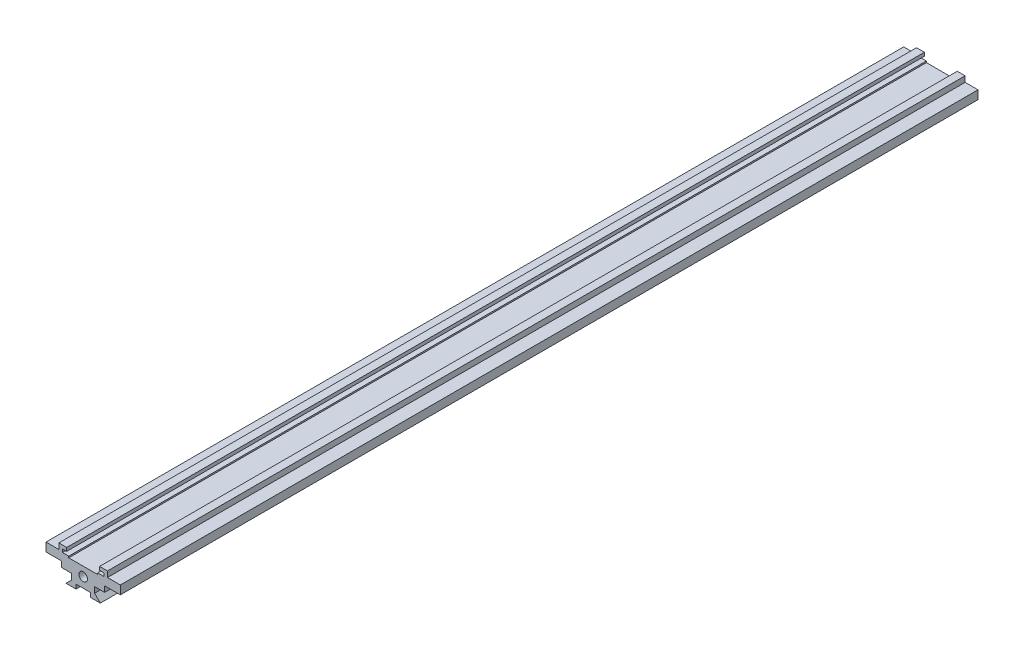
ISO-10303-21;
HEADER;
FILE_DESCRIPTION(('STEP AP214'),'2;1');
FILE_NAME('part.step','',(''),(''),'','','');
FILE_SCHEMA(('AUTOMOTIVE_DESIGN { 1 0 10303 214 1 1 1 1 }'));
ENDSEC;
DATA;
#1=APPLICATION_CONTEXT('core data for automotive mechanical design processes');
#2=APPLICATION_PROTOCOL_DEFINITION('international standard','automotive_design',2000,#1);
#3=PRODUCT_CONTEXT('',#1,'mechanical');
#4=PRODUCT('Part','Part','',(#3));
#5=PRODUCT_RELATED_PRODUCT_CATEGORY('part','',(#4));
#6=PRODUCT_DEFINITION_FORMATION('','',#4);
#7=PRODUCT_DEFINITION_CONTEXT('part definition',#1,'design');
#8=PRODUCT_DEFINITION('design','',#6,#7);
#9=PRODUCT_DEFINITION_SHAPE('','',#8);
#10=(LENGTH_UNIT() NAMED_UNIT(*) SI_UNIT(.MILLI.,.METRE.));
#11=(NAMED_UNIT(*) PLANE_ANGLE_UNIT() SI_UNIT($,.RADIAN.));
#12=(NAMED_UNIT(*) SI_UNIT($,.STERADIAN.) SOLID_ANGLE_UNIT());
#13=UNCERTAINTY_MEASURE_WITH_UNIT(LENGTH_MEASURE(1.E-05),#10,'distance_accuracy_value','');
#14=(GEOMETRIC_REPRESENTATION_CONTEXT(3) GLOBAL_UNCERTAINTY_ASSIGNED_CONTEXT((#13)) GLOBAL_UNIT_ASSIGNED_CONTEXT((#10,
#11,#12)) REPRESENTATION_CONTEXT('',''));
#15=CARTESIAN_POINT('',(0.,0.,0.));
#16=DIRECTION('',(0.,0.,1.));
#17=DIRECTION('',(1.,0.,0.));
#18=AXIS2_PLACEMENT_3D('',#15,#16,#17);
#19=CARTESIAN_POINT('',(-13.,9.,150.));
#20=DIRECTION('',(0.,0.,-1.));
#21=DIRECTION('',(-1.,0.,0.));
#22=AXIS2_PLACEMENT_3D('',#19,#20,#21);
#23=PLANE('',#22);
#24=DIRECTION('',(1.,0.,0.));
#25=VECTOR('',#24,1.);
#26=CARTESIAN_POINT('',(-6.,0.,150.));
#27=LINE('',#26,#25);
#28=CARTESIAN_POINT('',(-6.,0.,150.));
#29=VERTEX_POINT('',#28);
#30=CARTESIAN_POINT('',(-2.5,0.,150.));
#31=VERTEX_POINT('',#30);
#32=EDGE_CURVE('E298',#29,#31,#27,.T.);
#33=ORIENTED_EDGE('',*,*,#32,.T.);
#34=DIRECTION('',(0.,-1.,0.));
#35=VECTOR('',#34,1.);
#36=CARTESIAN_POINT('',(-2.5,0.,150.));
#37=LINE('',#36,#35);
#38=CARTESIAN_POINT('',(-2.5,1.5,150.));
#39=VERTEX_POINT('',#38);
#40=EDGE_CURVE('E484',#39,#31,#37,.T.);
#41=ORIENTED_EDGE('',*,*,#40,.F.);
#42=DIRECTION('',(-1.,0.,0.));
#43=VECTOR('',#42,1.);
#44=CARTESIAN_POINT('',(-2.5,1.5,150.));
#45=LINE('',#44,#43);
#46=CARTESIAN_POINT('',(2.5,1.5,150.));
#47=VERTEX_POINT('',#46);
#48=EDGE_CURVE('E489',#47,#39,#45,.T.);
#49=ORIENTED_EDGE('',*,*,#48,.F.);
#50=DIRECTION('',(0.,1.,0.));
#51=VECTOR('',#50,1.);
#52=CARTESIAN_POINT('',(2.5,0.,150.));
#53=LINE('',#52,#51);
#54=CARTESIAN_POINT('',(2.5,0.,150.));
#55=VERTEX_POINT('',#54);
#56=EDGE_CURVE('E487',#55,#47,#53,.T.);
#57=ORIENTED_EDGE('',*,*,#56,.F.);
#58=CARTESIAN_POINT('',(6.,0.,150.));
#59=VERTEX_POINT('',#58);
#60=EDGE_CURVE('E297',#55,#59,#27,.T.);
#61=ORIENTED_EDGE('',*,*,#60,.T.);
#62=DIRECTION('',(-0.707106781186549,0.707106781186546,0.));
#63=VECTOR('',#62,1.);
#64=CARTESIAN_POINT('',(6.,0.,150.));
#65=LINE('',#64,#63);
#66=CARTESIAN_POINT('',(4.,1.99999999999999,150.));
#67=VERTEX_POINT('',#66);
#68=EDGE_CURVE('E301',#59,#67,#65,.T.);
#69=ORIENTED_EDGE('',*,*,#68,.T.);
#70=DIRECTION('',(0.,1.,0.));
#71=VECTOR('',#70,1.);
#72=CARTESIAN_POINT('',(4.,1.99999999999999,150.));
#73=LINE('',#72,#71);
#74=CARTESIAN_POINT('',(4.,3.99999999999999,150.));
#75=VERTEX_POINT('',#74);
#76=EDGE_CURVE('E304',#67,#75,#73,.T.);
#77=ORIENTED_EDGE('',*,*,#76,.T.);
#78=DIRECTION('',(1.,0.,0.));
#79=VECTOR('',#78,1.);
#80=CARTESIAN_POINT('',(7.5,3.99999999999999,150.));
#81=LINE('',#80,#79);
#82=CARTESIAN_POINT('',(7.5,3.99999999999999,150.));
#83=VERTEX_POINT('',#82);
#84=EDGE_CURVE('E307',#75,#83,#81,.T.);
#85=ORIENTED_EDGE('',*,*,#84,.T.);
#86=DIRECTION('',(0.,1.,0.));
#87=VECTOR('',#86,1.);
#88=CARTESIAN_POINT('',(7.5,3.99999999999999,150.));
#89=LINE('',#88,#87);
#90=CARTESIAN_POINT('',(7.5,5.99999999999999,150.));
#91=VERTEX_POINT('',#90);
#92=EDGE_CURVE('E310',#83,#91,#89,.T.);
#93=ORIENTED_EDGE('',*,*,#92,.T.);
#94=DIRECTION('',(1.,0.,0.));
#95=VECTOR('',#94,1.);
#96=CARTESIAN_POINT('',(13.,5.99999999999999,150.));
#97=LINE('',#96,#95);
#98=CARTESIAN_POINT('',(13.,5.99999999999999,150.));
#99=VERTEX_POINT('',#98);
#100=EDGE_CURVE('E313',#91,#99,#97,.T.);
#101=ORIENTED_EDGE('',*,*,#100,.T.);
#102=DIRECTION('',(0.,1.,0.));
#103=VECTOR('',#102,1.);
#104=CARTESIAN_POINT('',(13.,5.99999999999999,150.));
#105=LINE('',#104,#103);
#106=CARTESIAN_POINT('',(13.,9.,150.));
#107=VERTEX_POINT('',#106);
#108=EDGE_CURVE('E316',#99,#107,#105,.T.);
#109=ORIENTED_EDGE('',*,*,#108,.T.);
#110=DIRECTION('',(-1.,0.,0.));
#111=VECTOR('',#110,1.);
#112=CARTESIAN_POINT('',(8.5,9.,150.));
#113=LINE('',#112,#111);
#114=CARTESIAN_POINT('',(8.5,9.,150.));
#115=VERTEX_POINT('',#114);
#116=EDGE_CURVE('E319',#107,#115,#113,.T.);
#117=ORIENTED_EDGE('',*,*,#116,.T.);
#118=DIRECTION('',(0.,1.,0.));
#119=VECTOR('',#118,1.);
#120=CARTESIAN_POINT('',(8.5,9.,150.));
#121=LINE('',#120,#119);
#122=CARTESIAN_POINT('',(8.5,11.,150.));
#123=VERTEX_POINT('',#122);
#124=EDGE_CURVE('E322',#115,#123,#121,.T.);
#125=ORIENTED_EDGE('',*,*,#124,.T.);
#126=DIRECTION('',(-1.,0.,0.));
#127=VECTOR('',#126,1.);
#128=CARTESIAN_POINT('',(8.5,11.,150.));
#129=LINE('',#128,#127);
#130=CARTESIAN_POINT('',(5.75,11.,150.));
#131=VERTEX_POINT('',#130);
#132=EDGE_CURVE('E325',#123,#131,#129,.T.);
#133=ORIENTED_EDGE('',*,*,#132,.T.);
#134=DIRECTION('',(0.,-1.,0.));
#135=VECTOR('',#134,1.);
#136=CARTESIAN_POINT('',(5.75,11.,150.));
#137=LINE('',#136,#135);
#138=CARTESIAN_POINT('',(5.75,9.79999999999999,150.));
#139=VERTEX_POINT('',#138);
#140=EDGE_CURVE('E328',#131,#139,#137,.T.);
#141=ORIENTED_EDGE('',*,*,#140,.T.);
#142=DIRECTION('',(1.,0.,0.));
#143=VECTOR('',#142,1.);
#144=CARTESIAN_POINT('',(5.75,9.79999999999999,150.));
#145=LINE('',#144,#143);
#146=CARTESIAN_POINT('',(7.25,9.8,150.));
#147=VERTEX_POINT('',#146);
#148=EDGE_CURVE('E331',#139,#147,#145,.T.);
#149=ORIENTED_EDGE('',*,*,#148,.T.);
#150=DIRECTION('',(0.,-1.,0.));
#151=VECTOR('',#150,1.);
#152=CARTESIAN_POINT('',(7.25,9.8,150.));
#153=LINE('',#152,#151);
#154=CARTESIAN_POINT('',(7.25,8.7,150.));
#155=VERTEX_POINT('',#154);
#156=EDGE_CURVE('E334',#147,#155,#153,.T.);
#157=ORIENTED_EDGE('',*,*,#156,.T.);
#158=DIRECTION('',(-1.,0.,0.));
#159=VECTOR('',#158,1.);
#160=CARTESIAN_POINT('',(5.05,8.7,150.));
#161=LINE('',#160,#159);
#162=CARTESIAN_POINT('',(5.05,8.7,150.));
#163=VERTEX_POINT('',#162);
#164=EDGE_CURVE('E337',#155,#163,#161,.T.);
#165=ORIENTED_EDGE('',*,*,#164,.T.);
#166=DIRECTION('',(0.,-1.,0.));
#167=VECTOR('',#166,1.);
#168=CARTESIAN_POINT('',(5.05,8.2,150.));
#169=LINE('',#168,#167);
#170=CARTESIAN_POINT('',(5.05,8.2,150.));
#171=VERTEX_POINT('',#170);
#172=EDGE_CURVE('E340',#163,#171,#169,.T.);
#173=ORIENTED_EDGE('',*,*,#172,.T.);
#174=DIRECTION('',(-1.,0.,0.));
#175=VECTOR('',#174,1.);
#176=CARTESIAN_POINT('',(5.05,8.2,150.));
#177=LINE('',#176,#175);
#178=CARTESIAN_POINT('',(-5.05,8.2,150.));
#179=VERTEX_POINT('',#178);
#180=EDGE_CURVE('E343',#171,#179,#177,.T.);
#181=ORIENTED_EDGE('',*,*,#180,.T.);
#182=DIRECTION('',(0.,1.,0.));
#183=VECTOR('',#182,1.);
#184=CARTESIAN_POINT('',(-5.05,8.2,150.));
#185=LINE('',#184,#183);
#186=CARTESIAN_POINT('',(-5.05,8.7,150.));
#187=VERTEX_POINT('',#186);
#188=EDGE_CURVE('E346',#179,#187,#185,.T.);
#189=ORIENTED_EDGE('',*,*,#188,.T.);
#190=DIRECTION('',(-1.,0.,0.));
#191=VECTOR('',#190,1.);
#192=CARTESIAN_POINT('',(-5.05,8.7,150.));
#193=LINE('',#192,#191);
#194=CARTESIAN_POINT('',(-7.25,8.7,150.));
#195=VERTEX_POINT('',#194);
#196=EDGE_CURVE('E349',#187,#195,#193,.T.);
#197=ORIENTED_EDGE('',*,*,#196,.T.);
#198=DIRECTION('',(0.,1.,0.));
#199=VECTOR('',#198,1.);
#200=CARTESIAN_POINT('',(-7.25,9.8,150.));
#201=LINE('',#200,#199);
#202=CARTESIAN_POINT('',(-7.25,9.8,150.));
#203=VERTEX_POINT('',#202);
#204=EDGE_CURVE('E352',#195,#203,#201,.T.);
#205=ORIENTED_EDGE('',*,*,#204,.T.);
#206=DIRECTION('',(1.,0.,0.));
#207=VECTOR('',#206,1.);
#208=CARTESIAN_POINT('',(-5.75,9.79999999999999,150.));
#209=LINE('',#208,#207);
#210=CARTESIAN_POINT('',(-5.75,9.79999999999999,150.));
#211=VERTEX_POINT('',#210);
#212=EDGE_CURVE('E355',#203,#211,#209,.T.);
#213=ORIENTED_EDGE('',*,*,#212,.T.);
#214=DIRECTION('',(0.,1.,0.));
#215=VECTOR('',#214,1.);
#216=CARTESIAN_POINT('',(-5.75,11.,150.));
#217=LINE('',#216,#215);
#218=CARTESIAN_POINT('',(-5.75,11.,150.));
#219=VERTEX_POINT('',#218);
#220=EDGE_CURVE('E358',#211,#219,#217,.T.);
#221=ORIENTED_EDGE('',*,*,#220,.T.);
#222=DIRECTION('',(-1.,0.,0.));
#223=VECTOR('',#222,1.);
#224=CARTESIAN_POINT('',(-8.5,11.,150.));
#225=LINE('',#224,#223);
#226=CARTESIAN_POINT('',(-8.5,11.,150.));
#227=VERTEX_POINT('',#226);
#228=EDGE_CURVE('E250',#219,#227,#225,.T.);
#229=ORIENTED_EDGE('',*,*,#228,.T.);
#230=DIRECTION('',(0.,-1.,0.));
#231=VECTOR('',#230,1.);
#232=CARTESIAN_POINT('',(-8.5,9.,150.));
#233=LINE('',#232,#231);
#234=CARTESIAN_POINT('',(-8.5,9.,150.));
#235=VERTEX_POINT('',#234);
#236=EDGE_CURVE('E361',#227,#235,#233,.T.);
#237=ORIENTED_EDGE('',*,*,#236,.T.);
#238=DIRECTION('',(-1.,0.,0.));
#239=VECTOR('',#238,1.);
#240=CARTESIAN_POINT('',(-8.5,9.,150.));
#241=LINE('',#240,#239);
#242=CARTESIAN_POINT('',(-13.,9.,150.));
#243=VERTEX_POINT('',#242);
#244=EDGE_CURVE('E275',#235,#243,#241,.T.);
#245=ORIENTED_EDGE('',*,*,#244,.T.);
#246=DIRECTION('',(0.,-1.,0.));
#247=VECTOR('',#246,1.);
#248=CARTESIAN_POINT('',(-13.,5.99999999999999,150.));
#249=LINE('',#248,#247);
#250=CARTESIAN_POINT('',(-13.,5.99999999999999,150.));
#251=VERTEX_POINT('',#250);
#252=EDGE_CURVE('E278',#243,#251,#249,.T.);
#253=ORIENTED_EDGE('',*,*,#252,.T.);
#254=DIRECTION('',(1.,0.,0.));
#255=VECTOR('',#254,1.);
#256=CARTESIAN_POINT('',(-7.5,5.99999999999999,150.));
#257=LINE('',#256,#255);
#258=CARTESIAN_POINT('',(-7.5,5.99999999999999,150.));
#259=VERTEX_POINT('',#258);
#260=EDGE_CURVE('E282',#251,#259,#257,.T.);
#261=ORIENTED_EDGE('',*,*,#260,.T.);
#262=DIRECTION('',(0.,-1.,0.));
#263=VECTOR('',#262,1.);
#264=CARTESIAN_POINT('',(-7.5,3.99999999999999,150.));
#265=LINE('',#264,#263);
#266=CARTESIAN_POINT('',(-7.5,3.99999999999999,150.));
#267=VERTEX_POINT('',#266);
#268=EDGE_CURVE('E285',#259,#267,#265,.T.);
#269=ORIENTED_EDGE('',*,*,#268,.T.);
#270=DIRECTION('',(1.,0.,0.));
#271=VECTOR('',#270,1.);
#272=CARTESIAN_POINT('',(-4.,3.99999999999999,150.));
#273=LINE('',#272,#271);
#274=CARTESIAN_POINT('',(-4.,3.99999999999999,150.));
#275=VERTEX_POINT('',#274);
#276=EDGE_CURVE('E288',#267,#275,#273,.T.);
#277=ORIENTED_EDGE('',*,*,#276,.T.);
#278=DIRECTION('',(0.,-1.,0.));
#279=VECTOR('',#278,1.);
#280=CARTESIAN_POINT('',(-4.,1.99999999999999,150.));
#281=LINE('',#280,#279);
#282=CARTESIAN_POINT('',(-4.,1.99999999999999,150.));
#283=VERTEX_POINT('',#282);
#284=EDGE_CURVE('E291',#275,#283,#281,.T.);
#285=ORIENTED_EDGE('',*,*,#284,.T.);
#286=DIRECTION('',(-0.707106781186549,-0.707106781186546,0.));
#287=VECTOR('',#286,1.);
#288=CARTESIAN_POINT('',(-6.,0.,150.));
#289=LINE('',#288,#287);
#290=EDGE_CURVE('E294',#283,#29,#289,.T.);
#291=ORIENTED_EDGE('',*,*,#290,.T.);
#292=EDGE_LOOP('',(#33,#41,#49,#57,#61,#69,#77,#85,#93,#101,#109,#117,#125,#133,#141,#149,#157,
#165,#173,#181,#189,#197,#205,#213,#221,#229,#237,#245,#253,#261,#269,#277,#285,#291));
#293=FACE_BOUND('',#292,.T.);
#294=CARTESIAN_POINT('',(0.,5.,150.));
#295=DIRECTION('',(0.,0.,-1.));
#296=DIRECTION('',(-1.,0.,0.));
#297=AXIS2_PLACEMENT_3D('',#294,#295,#296);
#298=CIRCLE('',#297,1.5);
#299=CARTESIAN_POINT('',(-1.5,5.,150.));
#300=VERTEX_POINT('',#299);
#301=EDGE_CURVE('E472',#300,#300,#298,.T.);
#302=ORIENTED_EDGE('',*,*,#301,.T.);
#303=EDGE_LOOP('',(#302));
#304=FACE_BOUND('',#303,.T.);
#305=ADVANCED_FACE('F31',(#293,#304),#23,.F.);
#306=CARTESIAN_POINT('',(-6.,0.,-150.));
#307=DIRECTION('',(0.,-1.,0.));
#308=DIRECTION('',(0.,0.,-1.));
#309=AXIS2_PLACEMENT_3D('',#306,#307,#308);
#310=PLANE('',#309);
#311=DIRECTION('',(0.,0.,1.));
#312=VECTOR('',#311,1.);
#313=CARTESIAN_POINT('',(-2.5,0.,-150.001));
#314=LINE('',#313,#312);
#315=CARTESIAN_POINT('',(-2.5,0.,-150.));
#316=VERTEX_POINT('',#315);
#317=EDGE_CURVE('E492',#316,#31,#314,.T.);
#318=ORIENTED_EDGE('',*,*,#317,.T.);
#319=ORIENTED_EDGE('',*,*,#32,.F.);
#320=DIRECTION('',(0.,0.,1.));
#321=VECTOR('',#320,1.);
#322=CARTESIAN_POINT('',(-6.,0.,-150.));
#323=LINE('',#322,#321);
#324=CARTESIAN_POINT('',(-6.,0.,-150.));
#325=VERTEX_POINT('',#324);
#326=EDGE_CURVE('E406',#325,#29,#323,.T.);
#327=ORIENTED_EDGE('',*,*,#326,.F.);
#328=DIRECTION('',(1.,0.,0.));
#329=VECTOR('',#328,1.);
#330=CARTESIAN_POINT('',(-6.,0.,-150.));
#331=LINE('',#330,#329);
#332=EDGE_CURVE('E526',#325,#316,#331,.T.);
#333=ORIENTED_EDGE('',*,*,#332,.T.);
#334=EDGE_LOOP('',(#318,#319,#327,#333));
#335=FACE_BOUND('',#334,.T.);
#336=ADVANCED_FACE('F428',(#335),#310,.T.);
#337=CARTESIAN_POINT('',(-8.5,9.,-150.));
#338=DIRECTION('',(0.,1.,0.));
#339=DIRECTION('',(0.,0.,1.));
#340=AXIS2_PLACEMENT_3D('',#337,#338,#339);
#341=PLANE('',#340);
#342=ORIENTED_EDGE('',*,*,#244,.F.);
#343=DIRECTION('',(0.,0.,1.));
#344=VECTOR('',#343,1.);
#345=CARTESIAN_POINT('',(-8.5,9.,-150.));
#346=LINE('',#345,#344);
#347=CARTESIAN_POINT('',(-8.5,9.,-150.));
#348=VERTEX_POINT('',#347);
#349=EDGE_CURVE('E11',#348,#235,#346,.T.);
#350=ORIENTED_EDGE('',*,*,#349,.F.);
#351=DIRECTION('',(-1.,0.,0.));
#352=VECTOR('',#351,1.);
#353=CARTESIAN_POINT('',(-8.5,9.,-150.));
#354=LINE('',#353,#352);
#355=CARTESIAN_POINT('',(-13.,9.,-150.));
#356=VERTEX_POINT('',#355);
#357=EDGE_CURVE('E363',#348,#356,#354,.T.);
#358=ORIENTED_EDGE('',*,*,#357,.T.);
#359=DIRECTION('',(0.,0.,1.));
#360=VECTOR('',#359,1.);
#361=CARTESIAN_POINT('',(-13.,9.,-150.));
#362=LINE('',#361,#360);
#363=EDGE_CURVE('E35',#356,#243,#362,.T.);
#364=ORIENTED_EDGE('',*,*,#363,.T.);
#365=EDGE_LOOP('',(#342,#350,#358,#364));
#366=FACE_BOUND('',#365,.T.);
#367=ADVANCED_FACE('F33',(#366),#341,.T.);
#368=CARTESIAN_POINT('',(-8.5,9.,-150.));
#369=DIRECTION('',(-1.,0.,0.));
#370=DIRECTION('',(0.,0.,1.));
#371=AXIS2_PLACEMENT_3D('',#368,#369,#370);
#372=PLANE('',#371);
#373=ORIENTED_EDGE('',*,*,#236,.F.);
#374=DIRECTION('',(0.,0.,1.));
#375=VECTOR('',#374,1.);
#376=CARTESIAN_POINT('',(-8.5,11.,-150.));
#377=LINE('',#376,#375);
#378=CARTESIAN_POINT('',(-8.5,11.,-150.));
#379=VERTEX_POINT('',#378);
#380=EDGE_CURVE('E40',#379,#227,#377,.T.);
#381=ORIENTED_EDGE('',*,*,#380,.F.);
#382=DIRECTION('',(0.,-1.,0.));
#383=VECTOR('',#382,1.);
#384=CARTESIAN_POINT('',(-8.5,9.,-150.));
#385=LINE('',#384,#383);
#386=EDGE_CURVE('E265',#379,#348,#385,.T.);
#387=ORIENTED_EDGE('',*,*,#386,.T.);
#388=ORIENTED_EDGE('',*,*,#349,.T.);
#389=EDGE_LOOP('',(#373,#381,#387,#388));
#390=FACE_BOUND('',#389,.T.);
#391=ADVANCED_FACE('F420',(#390),#372,.T.);
#392=CARTESIAN_POINT('',(-8.5,11.,-150.));
#393=DIRECTION('',(0.,1.,0.));
#394=DIRECTION('',(0.,0.,1.));
#395=AXIS2_PLACEMENT_3D('',#392,#393,#394);
#396=PLANE('',#395);
#397=ORIENTED_EDGE('',*,*,#228,.F.);
#398=DIRECTION('',(0.,0.,1.));
#399=VECTOR('',#398,1.);
#400=CARTESIAN_POINT('',(-5.75,11.,-150.));
#401=LINE('',#400,#399);
#402=CARTESIAN_POINT('',(-5.75,11.,-150.));
#403=VERTEX_POINT('',#402);
#404=EDGE_CURVE('E244',#403,#219,#401,.T.);
#405=ORIENTED_EDGE('',*,*,#404,.F.);
#406=DIRECTION('',(-1.,0.,0.));
#407=VECTOR('',#406,1.);
#408=CARTESIAN_POINT('',(-8.5,11.,-150.));
#409=LINE('',#408,#407);
#410=EDGE_CURVE('E247',#403,#379,#409,.T.);
#411=ORIENTED_EDGE('',*,*,#410,.T.);
#412=ORIENTED_EDGE('',*,*,#380,.T.);
#413=EDGE_LOOP('',(#397,#405,#411,#412));
#414=FACE_BOUND('',#413,.T.);
#415=ADVANCED_FACE('F246',(#414),#396,.T.);
#416=CARTESIAN_POINT('',(-5.75,11.,-150.));
#417=DIRECTION('',(1.,0.,0.));
#418=DIRECTION('',(0.,0.,-1.));
#419=AXIS2_PLACEMENT_3D('',#416,#417,#418);
#420=PLANE('',#419);
#421=ORIENTED_EDGE('',*,*,#220,.F.);
#422=DIRECTION('',(0.,0.,1.));
#423=VECTOR('',#422,1.);
#424=CARTESIAN_POINT('',(-5.75,9.79999999999999,-150.));
#425=LINE('',#424,#423);
#426=CARTESIAN_POINT('',(-5.75,9.79999999999999,-150.));
#427=VERTEX_POINT('',#426);
#428=EDGE_CURVE('E255',#427,#211,#425,.T.);
#429=ORIENTED_EDGE('',*,*,#428,.F.);
#430=DIRECTION('',(0.,1.,0.));
#431=VECTOR('',#430,1.);
#432=CARTESIAN_POINT('',(-5.75,11.,-150.));
#433=LINE('',#432,#431);
#434=EDGE_CURVE('E263',#427,#403,#433,.T.);
#435=ORIENTED_EDGE('',*,*,#434,.T.);
#436=ORIENTED_EDGE('',*,*,#404,.T.);
#437=EDGE_LOOP('',(#421,#429,#435,#436));
#438=FACE_BOUND('',#437,.T.);
#439=ADVANCED_FACE('F267',(#438),#420,.T.);
#440=CARTESIAN_POINT('',(-5.75,9.79999999999999,-150.));
#441=DIRECTION('',(0.,-1.,0.));
#442=DIRECTION('',(1.,0.,0.));
#443=AXIS2_PLACEMENT_3D('',#440,#441,#442);
#444=PLANE('',#443);
#445=ORIENTED_EDGE('',*,*,#212,.F.);
#446=DIRECTION('',(0.,0.,1.));
#447=VECTOR('',#446,1.);
#448=CARTESIAN_POINT('',(-7.25,9.8,-150.));
#449=LINE('',#448,#447);
#450=CARTESIAN_POINT('',(-7.25,9.8,-150.));
#451=VERTEX_POINT('',#450);
#452=EDGE_CURVE('E367',#451,#203,#449,.T.);
#453=ORIENTED_EDGE('',*,*,#452,.F.);
#454=DIRECTION('',(1.,0.,0.));
#455=VECTOR('',#454,1.);
#456=CARTESIAN_POINT('',(-5.75,9.79999999999999,-150.));
#457=LINE('',#456,#455);
#458=EDGE_CURVE('E268',#451,#427,#457,.T.);
#459=ORIENTED_EDGE('',*,*,#458,.T.);
#460=ORIENTED_EDGE('',*,*,#428,.T.);
#461=EDGE_LOOP('',(#445,#453,#459,#460));
#462=FACE_BOUND('',#461,.T.);
#463=ADVANCED_FACE('F697',(#462),#444,.T.);
#464=CARTESIAN_POINT('',(-7.25,9.8,-150.));
#465=DIRECTION('',(1.,0.,0.));
#466=DIRECTION('',(0.,0.,-1.));
#467=AXIS2_PLACEMENT_3D('',#464,#465,#466);
#468=PLANE('',#467);
#469=ORIENTED_EDGE('',*,*,#204,.F.);
#470=DIRECTION('',(0.,0.,1.));
#471=VECTOR('',#470,1.);
#472=CARTESIAN_POINT('',(-7.25,8.7,-150.));
#473=LINE('',#472,#471);
#474=CARTESIAN_POINT('',(-7.25,8.7,-150.));
#475=VERTEX_POINT('',#474);
#476=EDGE_CURVE('E369',#475,#195,#473,.T.);
#477=ORIENTED_EDGE('',*,*,#476,.F.);
#478=DIRECTION('',(0.,1.,0.));
#479=VECTOR('',#478,1.);
#480=CARTESIAN_POINT('',(-7.25,9.8,-150.));
#481=LINE('',#480,#479);
#482=EDGE_CURVE('E270',#475,#451,#481,.T.);
#483=ORIENTED_EDGE('',*,*,#482,.T.);
#484=ORIENTED_EDGE('',*,*,#452,.T.);
#485=EDGE_LOOP('',(#469,#477,#483,#484));
#486=FACE_BOUND('',#485,.T.);
#487=ADVANCED_FACE('F583',(#486),#468,.T.);
#488=CARTESIAN_POINT('',(-5.05,8.7,-150.));
#489=DIRECTION('',(0.,1.,0.));
#490=DIRECTION('',(-1.,0.,0.));
#491=AXIS2_PLACEMENT_3D('',#488,#489,#490);
#492=PLANE('',#491);
#493=ORIENTED_EDGE('',*,*,#196,.F.);
#494=DIRECTION('',(0.,0.,1.));
#495=VECTOR('',#494,1.);
#496=CARTESIAN_POINT('',(-5.05,8.7,-150.));
#497=LINE('',#496,#495);
#498=CARTESIAN_POINT('',(-5.05,8.7,-150.));
#499=VERTEX_POINT('',#498);
#500=EDGE_CURVE('E371',#499,#187,#497,.T.);
#501=ORIENTED_EDGE('',*,*,#500,.F.);
#502=DIRECTION('',(-1.,0.,0.));
#503=VECTOR('',#502,1.);
#504=CARTESIAN_POINT('',(-5.05,8.7,-150.));
#505=LINE('',#504,#503);
#506=EDGE_CURVE('E577',#499,#475,#505,.T.);
#507=ORIENTED_EDGE('',*,*,#506,.T.);
#508=ORIENTED_EDGE('',*,*,#476,.T.);
#509=EDGE_LOOP('',(#493,#501,#507,#508));
#510=FACE_BOUND('',#509,.T.);
#511=ADVANCED_FACE('F589',(#510),#492,.T.);
#512=CARTESIAN_POINT('',(-5.05,8.2,-150.));
#513=DIRECTION('',(1.,0.,0.));
#514=DIRECTION('',(0.,0.,-1.));
#515=AXIS2_PLACEMENT_3D('',#512,#513,#514);
#516=PLANE('',#515);
#517=ORIENTED_EDGE('',*,*,#188,.F.);
#518=DIRECTION('',(0.,0.,1.));
#519=VECTOR('',#518,1.);
#520=CARTESIAN_POINT('',(-5.05,8.2,-150.));
#521=LINE('',#520,#519);
#522=CARTESIAN_POINT('',(-5.05,8.2,-150.));
#523=VERTEX_POINT('',#522);
#524=EDGE_CURVE('E373',#523,#179,#521,.T.);
#525=ORIENTED_EDGE('',*,*,#524,.F.);
#526=DIRECTION('',(0.,1.,0.));
#527=VECTOR('',#526,1.);
#528=CARTESIAN_POINT('',(-5.05,8.2,-150.));
#529=LINE('',#528,#527);
#530=EDGE_CURVE('E574',#523,#499,#529,.T.);
#531=ORIENTED_EDGE('',*,*,#530,.T.);
#532=ORIENTED_EDGE('',*,*,#500,.T.);
#533=EDGE_LOOP('',(#517,#525,#531,#532));
#534=FACE_BOUND('',#533,.T.);
#535=ADVANCED_FACE('F592',(#534),#516,.T.);
#536=CARTESIAN_POINT('',(5.05,8.2,-150.));
#537=DIRECTION('',(0.,1.,0.));
#538=DIRECTION('',(0.,0.,1.));
#539=AXIS2_PLACEMENT_3D('',#536,#537,#538);
#540=PLANE('',#539);
#541=ORIENTED_EDGE('',*,*,#180,.F.);
#542=DIRECTION('',(0.,0.,1.));
#543=VECTOR('',#542,1.);
#544=CARTESIAN_POINT('',(5.05,8.2,-150.));
#545=LINE('',#544,#543);
#546=CARTESIAN_POINT('',(5.05,8.2,-150.));
#547=VERTEX_POINT('',#546);
#548=EDGE_CURVE('E375',#547,#171,#545,.T.);
#549=ORIENTED_EDGE('',*,*,#548,.F.);
#550=DIRECTION('',(-1.,0.,0.));
#551=VECTOR('',#550,1.);
#552=CARTESIAN_POINT('',(5.05,8.2,-150.));
#553=LINE('',#552,#551);
#554=EDGE_CURVE('E571',#547,#523,#553,.T.);
#555=ORIENTED_EDGE('',*,*,#554,.T.);
#556=ORIENTED_EDGE('',*,*,#524,.T.);
#557=EDGE_LOOP('',(#541,#549,#555,#556));
#558=FACE_BOUND('',#557,.T.);
#559=ADVANCED_FACE('F597',(#558),#540,.T.);
#560=CARTESIAN_POINT('',(5.05,8.2,-150.));
#561=DIRECTION('',(-1.,0.,0.));
#562=DIRECTION('',(0.,0.,1.));
#563=AXIS2_PLACEMENT_3D('',#560,#561,#562);
#564=PLANE('',#563);
#565=ORIENTED_EDGE('',*,*,#172,.F.);
#566=DIRECTION('',(0.,0.,1.));
#567=VECTOR('',#566,1.);
#568=CARTESIAN_POINT('',(5.05,8.7,-150.));
#569=LINE('',#568,#567);
#570=CARTESIAN_POINT('',(5.05,8.7,-150.));
#571=VERTEX_POINT('',#570);
#572=EDGE_CURVE('E377',#571,#163,#569,.T.);
#573=ORIENTED_EDGE('',*,*,#572,.F.);
#574=DIRECTION('',(0.,-1.,0.));
#575=VECTOR('',#574,1.);
#576=CARTESIAN_POINT('',(5.05,8.2,-150.));
#577=LINE('',#576,#575);
#578=EDGE_CURVE('E568',#571,#547,#577,.T.);
#579=ORIENTED_EDGE('',*,*,#578,.T.);
#580=ORIENTED_EDGE('',*,*,#548,.T.);
#581=EDGE_LOOP('',(#565,#573,#579,#580));
#582=FACE_BOUND('',#581,.T.);
#583=ADVANCED_FACE('F600',(#582),#564,.T.);
#584=CARTESIAN_POINT('',(5.05,8.7,-150.));
#585=DIRECTION('',(0.,1.,0.));
#586=DIRECTION('',(-1.,0.,0.));
#587=AXIS2_PLACEMENT_3D('',#584,#585,#586);
#588=PLANE('',#587);
#589=ORIENTED_EDGE('',*,*,#164,.F.);
#590=DIRECTION('',(0.,0.,1.));
#591=VECTOR('',#590,1.);
#592=CARTESIAN_POINT('',(7.25,8.7,-150.));
#593=LINE('',#592,#591);
#594=CARTESIAN_POINT('',(7.25,8.7,-150.));
#595=VERTEX_POINT('',#594);
#596=EDGE_CURVE('E379',#595,#155,#593,.T.);
#597=ORIENTED_EDGE('',*,*,#596,.F.);
#598=DIRECTION('',(-1.,0.,0.));
#599=VECTOR('',#598,1.);
#600=CARTESIAN_POINT('',(5.05,8.7,-150.));
#601=LINE('',#600,#599);
#602=EDGE_CURVE('E565',#595,#571,#601,.T.);
#603=ORIENTED_EDGE('',*,*,#602,.T.);
#604=ORIENTED_EDGE('',*,*,#572,.T.);
#605=EDGE_LOOP('',(#589,#597,#603,#604));
#606=FACE_BOUND('',#605,.T.);
#607=ADVANCED_FACE('F605',(#606),#588,.T.);
#608=CARTESIAN_POINT('',(7.25,9.8,-150.));
#609=DIRECTION('',(-1.,0.,0.));
#610=DIRECTION('',(0.,0.,1.));
#611=AXIS2_PLACEMENT_3D('',#608,#609,#610);
#612=PLANE('',#611);
#613=ORIENTED_EDGE('',*,*,#156,.F.);
#614=DIRECTION('',(0.,0.,1.));
#615=VECTOR('',#614,1.);
#616=CARTESIAN_POINT('',(7.25,9.8,-150.));
#617=LINE('',#616,#615);
#618=CARTESIAN_POINT('',(7.25,9.8,-150.));
#619=VERTEX_POINT('',#618);
#620=EDGE_CURVE('E381',#619,#147,#617,.T.);
#621=ORIENTED_EDGE('',*,*,#620,.F.);
#622=DIRECTION('',(0.,-1.,0.));
#623=VECTOR('',#622,1.);
#624=CARTESIAN_POINT('',(7.25,9.8,-150.));
#625=LINE('',#624,#623);
#626=EDGE_CURVE('E562',#619,#595,#625,.T.);
#627=ORIENTED_EDGE('',*,*,#626,.T.);
#628=ORIENTED_EDGE('',*,*,#596,.T.);
#629=EDGE_LOOP('',(#613,#621,#627,#628));
#630=FACE_BOUND('',#629,.T.);
#631=ADVANCED_FACE('F608',(#630),#612,.T.);
#632=CARTESIAN_POINT('',(5.75,9.79999999999999,-150.));
#633=DIRECTION('',(0.,-1.,0.));
#634=DIRECTION('',(1.,0.,0.));
#635=AXIS2_PLACEMENT_3D('',#632,#633,#634);
#636=PLANE('',#635);
#637=ORIENTED_EDGE('',*,*,#148,.F.);
#638=DIRECTION('',(0.,0.,1.));
#639=VECTOR('',#638,1.);
#640=CARTESIAN_POINT('',(5.75,9.79999999999999,-150.));
#641=LINE('',#640,#639);
#642=CARTESIAN_POINT('',(5.75,9.79999999999999,-150.));
#643=VERTEX_POINT('',#642);
#644=EDGE_CURVE('E383',#643,#139,#641,.T.);
#645=ORIENTED_EDGE('',*,*,#644,.F.);
#646=DIRECTION('',(1.,0.,0.));
#647=VECTOR('',#646,1.);
#648=CARTESIAN_POINT('',(5.75,9.79999999999999,-150.));
#649=LINE('',#648,#647);
#650=EDGE_CURVE('E559',#643,#619,#649,.T.);
#651=ORIENTED_EDGE('',*,*,#650,.T.);
#652=ORIENTED_EDGE('',*,*,#620,.T.);
#653=EDGE_LOOP('',(#637,#645,#651,#652));
#654=FACE_BOUND('',#653,.T.);
#655=ADVANCED_FACE('F613',(#654),#636,.T.);
#656=CARTESIAN_POINT('',(5.75,11.,-150.));
#657=DIRECTION('',(-1.,0.,0.));
#658=DIRECTION('',(0.,0.,1.));
#659=AXIS2_PLACEMENT_3D('',#656,#657,#658);
#660=PLANE('',#659);
#661=ORIENTED_EDGE('',*,*,#140,.F.);
#662=DIRECTION('',(0.,0.,1.));
#663=VECTOR('',#662,1.);
#664=CARTESIAN_POINT('',(5.75,11.,-150.));
#665=LINE('',#664,#663);
#666=CARTESIAN_POINT('',(5.75,11.,-150.));
#667=VERTEX_POINT('',#666);
#668=EDGE_CURVE('E385',#667,#131,#665,.T.);
#669=ORIENTED_EDGE('',*,*,#668,.F.);
#670=DIRECTION('',(0.,-1.,0.));
#671=VECTOR('',#670,1.);
#672=CARTESIAN_POINT('',(5.75,11.,-150.));
#673=LINE('',#672,#671);
#674=EDGE_CURVE('E556',#667,#643,#673,.T.);
#675=ORIENTED_EDGE('',*,*,#674,.T.);
#676=ORIENTED_EDGE('',*,*,#644,.T.);
#677=EDGE_LOOP('',(#661,#669,#675,#676));
#678=FACE_BOUND('',#677,.T.);
#679=ADVANCED_FACE('F616',(#678),#660,.T.);
#680=CARTESIAN_POINT('',(8.5,11.,-150.));
#681=DIRECTION('',(0.,1.,0.));
#682=DIRECTION('',(0.,0.,1.));
#683=AXIS2_PLACEMENT_3D('',#680,#681,#682);
#684=PLANE('',#683);
#685=ORIENTED_EDGE('',*,*,#132,.F.);
#686=DIRECTION('',(0.,0.,1.));
#687=VECTOR('',#686,1.);
#688=CARTESIAN_POINT('',(8.5,11.,-150.));
#689=LINE('',#688,#687);
#690=CARTESIAN_POINT('',(8.5,11.,-150.));
#691=VERTEX_POINT('',#690);
#692=EDGE_CURVE('E387',#691,#123,#689,.T.);
#693=ORIENTED_EDGE('',*,*,#692,.F.);
#694=DIRECTION('',(-1.,0.,0.));
#695=VECTOR('',#694,1.);
#696=CARTESIAN_POINT('',(8.5,11.,-150.));
#697=LINE('',#696,#695);
#698=EDGE_CURVE('E553',#691,#667,#697,.T.);
#699=ORIENTED_EDGE('',*,*,#698,.T.);
#700=ORIENTED_EDGE('',*,*,#668,.T.);
#701=EDGE_LOOP('',(#685,#693,#699,#700));
#702=FACE_BOUND('',#701,.T.);
#703=ADVANCED_FACE('F621',(#702),#684,.T.);
#704=CARTESIAN_POINT('',(8.5,9.,-150.));
#705=DIRECTION('',(1.,0.,0.));
#706=DIRECTION('',(0.,0.,-1.));
#707=AXIS2_PLACEMENT_3D('',#704,#705,#706);
#708=PLANE('',#707);
#709=ORIENTED_EDGE('',*,*,#124,.F.);
#710=DIRECTION('',(0.,0.,1.));
#711=VECTOR('',#710,1.);
#712=CARTESIAN_POINT('',(8.5,9.,-150.));
#713=LINE('',#712,#711);
#714=CARTESIAN_POINT('',(8.5,9.,-150.));
#715=VERTEX_POINT('',#714);
#716=EDGE_CURVE('E389',#715,#115,#713,.T.);
#717=ORIENTED_EDGE('',*,*,#716,.F.);
#718=DIRECTION('',(0.,1.,0.));
#719=VECTOR('',#718,1.);
#720=CARTESIAN_POINT('',(8.5,9.,-150.));
#721=LINE('',#720,#719);
#722=EDGE_CURVE('E550',#715,#691,#721,.T.);
#723=ORIENTED_EDGE('',*,*,#722,.T.);
#724=ORIENTED_EDGE('',*,*,#692,.T.);
#725=EDGE_LOOP('',(#709,#717,#723,#724));
#726=FACE_BOUND('',#725,.T.);
#727=ADVANCED_FACE('F624',(#726),#708,.T.);
#728=CARTESIAN_POINT('',(8.5,9.,-150.));
#729=DIRECTION('',(0.,1.,0.));
#730=DIRECTION('',(0.,0.,1.));
#731=AXIS2_PLACEMENT_3D('',#728,#729,#730);
#732=PLANE('',#731);
#733=ORIENTED_EDGE('',*,*,#116,.F.);
#734=DIRECTION('',(0.,0.,1.));
#735=VECTOR('',#734,1.);
#736=CARTESIAN_POINT('',(13.,9.,-150.));
#737=LINE('',#736,#735);
#738=CARTESIAN_POINT('',(13.,9.,-150.));
#739=VERTEX_POINT('',#738);
#740=EDGE_CURVE('E391',#739,#107,#737,.T.);
#741=ORIENTED_EDGE('',*,*,#740,.F.);
#742=DIRECTION('',(-1.,0.,0.));
#743=VECTOR('',#742,1.);
#744=CARTESIAN_POINT('',(8.5,9.,-150.));
#745=LINE('',#744,#743);
#746=EDGE_CURVE('E547',#739,#715,#745,.T.);
#747=ORIENTED_EDGE('',*,*,#746,.T.);
#748=ORIENTED_EDGE('',*,*,#716,.T.);
#749=EDGE_LOOP('',(#733,#741,#747,#748));
#750=FACE_BOUND('',#749,.T.);
#751=ADVANCED_FACE('F629',(#750),#732,.T.);
#752=CARTESIAN_POINT('',(13.,5.99999999999999,-150.));
#753=DIRECTION('',(1.,0.,0.));
#754=DIRECTION('',(0.,1.,0.));
#755=AXIS2_PLACEMENT_3D('',#752,#753,#754);
#756=PLANE('',#755);
#757=ORIENTED_EDGE('',*,*,#108,.F.);
#758=DIRECTION('',(0.,0.,1.));
#759=VECTOR('',#758,1.);
#760=CARTESIAN_POINT('',(13.,5.99999999999999,-150.));
#761=LINE('',#760,#759);
#762=CARTESIAN_POINT('',(13.,5.99999999999999,-150.));
#763=VERTEX_POINT('',#762);
#764=EDGE_CURVE('E393',#763,#99,#761,.T.);
#765=ORIENTED_EDGE('',*,*,#764,.F.);
#766=DIRECTION('',(0.,1.,0.));
#767=VECTOR('',#766,1.);
#768=CARTESIAN_POINT('',(13.,5.99999999999999,-150.));
#769=LINE('',#768,#767);
#770=EDGE_CURVE('E544',#763,#739,#769,.T.);
#771=ORIENTED_EDGE('',*,*,#770,.T.);
#772=ORIENTED_EDGE('',*,*,#740,.T.);
#773=EDGE_LOOP('',(#757,#765,#771,#772));
#774=FACE_BOUND('',#773,.T.);
#775=ADVANCED_FACE('F632',(#774),#756,.T.);
#776=CARTESIAN_POINT('',(13.,5.99999999999999,-150.));
#777=DIRECTION('',(0.,-1.,0.));
#778=DIRECTION('',(0.,0.,-1.));
#779=AXIS2_PLACEMENT_3D('',#776,#777,#778);
#780=PLANE('',#779);
#781=ORIENTED_EDGE('',*,*,#100,.F.);
#782=DIRECTION('',(0.,0.,1.));
#783=VECTOR('',#782,1.);
#784=CARTESIAN_POINT('',(7.5,5.99999999999999,-150.));
#785=LINE('',#784,#783);
#786=CARTESIAN_POINT('',(7.5,5.99999999999999,-150.));
#787=VERTEX_POINT('',#786);
#788=EDGE_CURVE('E395',#787,#91,#785,.T.);
#789=ORIENTED_EDGE('',*,*,#788,.F.);
#790=DIRECTION('',(1.,0.,0.));
#791=VECTOR('',#790,1.);
#792=CARTESIAN_POINT('',(13.,5.99999999999999,-150.));
#793=LINE('',#792,#791);
#794=EDGE_CURVE('E541',#787,#763,#793,.T.);
#795=ORIENTED_EDGE('',*,*,#794,.T.);
#796=ORIENTED_EDGE('',*,*,#764,.T.);
#797=EDGE_LOOP('',(#781,#789,#795,#796));
#798=FACE_BOUND('',#797,.T.);
#799=ADVANCED_FACE('F637',(#798),#780,.T.);
#800=CARTESIAN_POINT('',(7.5,3.99999999999999,-150.));
#801=DIRECTION('',(1.,0.,0.));
#802=DIRECTION('',(0.,0.,-1.));
#803=AXIS2_PLACEMENT_3D('',#800,#801,#802);
#804=PLANE('',#803);
#805=ORIENTED_EDGE('',*,*,#92,.F.);
#806=DIRECTION('',(0.,0.,1.));
#807=VECTOR('',#806,1.);
#808=CARTESIAN_POINT('',(7.5,3.99999999999999,-150.));
#809=LINE('',#808,#807);
#810=CARTESIAN_POINT('',(7.5,3.99999999999999,-150.));
#811=VERTEX_POINT('',#810);
#812=EDGE_CURVE('E397',#811,#83,#809,.T.);
#813=ORIENTED_EDGE('',*,*,#812,.F.);
#814=DIRECTION('',(0.,1.,0.));
#815=VECTOR('',#814,1.);
#816=CARTESIAN_POINT('',(7.5,3.99999999999999,-150.));
#817=LINE('',#816,#815);
#818=EDGE_CURVE('E538',#811,#787,#817,.T.);
#819=ORIENTED_EDGE('',*,*,#818,.T.);
#820=ORIENTED_EDGE('',*,*,#788,.T.);
#821=EDGE_LOOP('',(#805,#813,#819,#820));
#822=FACE_BOUND('',#821,.T.);
#823=ADVANCED_FACE('F640',(#822),#804,.T.);
#824=CARTESIAN_POINT('',(7.5,3.99999999999999,-150.));
#825=DIRECTION('',(0.,-1.,0.));
#826=DIRECTION('',(0.,0.,-1.));
#827=AXIS2_PLACEMENT_3D('',#824,#825,#826);
#828=PLANE('',#827);
#829=ORIENTED_EDGE('',*,*,#84,.F.);
#830=DIRECTION('',(0.,0.,1.));
#831=VECTOR('',#830,1.);
#832=CARTESIAN_POINT('',(4.,3.99999999999999,-150.));
#833=LINE('',#832,#831);
#834=CARTESIAN_POINT('',(4.,3.99999999999999,-150.));
#835=VERTEX_POINT('',#834);
#836=EDGE_CURVE('E399',#835,#75,#833,.T.);
#837=ORIENTED_EDGE('',*,*,#836,.F.);
#838=DIRECTION('',(1.,0.,0.));
#839=VECTOR('',#838,1.);
#840=CARTESIAN_POINT('',(7.5,3.99999999999999,-150.));
#841=LINE('',#840,#839);
#842=EDGE_CURVE('E535',#835,#811,#841,.T.);
#843=ORIENTED_EDGE('',*,*,#842,.T.);
#844=ORIENTED_EDGE('',*,*,#812,.T.);
#845=EDGE_LOOP('',(#829,#837,#843,#844));
#846=FACE_BOUND('',#845,.T.);
#847=ADVANCED_FACE('F645',(#846),#828,.T.);
#848=CARTESIAN_POINT('',(4.,1.99999999999999,-150.));
#849=DIRECTION('',(1.,0.,0.));
#850=DIRECTION('',(0.,0.,-1.));
#851=AXIS2_PLACEMENT_3D('',#848,#849,#850);
#852=PLANE('',#851);
#853=ORIENTED_EDGE('',*,*,#76,.F.);
#854=DIRECTION('',(0.,0.,1.));
#855=VECTOR('',#854,1.);
#856=CARTESIAN_POINT('',(4.,1.99999999999999,-150.));
#857=LINE('',#856,#855);
#858=CARTESIAN_POINT('',(4.,1.99999999999999,-150.));
#859=VERTEX_POINT('',#858);
#860=EDGE_CURVE('E401',#859,#67,#857,.T.);
#861=ORIENTED_EDGE('',*,*,#860,.F.);
#862=DIRECTION('',(0.,1.,0.));
#863=VECTOR('',#862,1.);
#864=CARTESIAN_POINT('',(4.,1.99999999999999,-150.));
#865=LINE('',#864,#863);
#866=EDGE_CURVE('E532',#859,#835,#865,.T.);
#867=ORIENTED_EDGE('',*,*,#866,.T.);
#868=ORIENTED_EDGE('',*,*,#836,.T.);
#869=EDGE_LOOP('',(#853,#861,#867,#868));
#870=FACE_BOUND('',#869,.T.);
#871=ADVANCED_FACE('F648',(#870),#852,.T.);
#872=CARTESIAN_POINT('',(6.,0.,-150.));
#873=DIRECTION('',(0.707106781186546,0.707106781186549,0.));
#874=DIRECTION('',(-0.707106781186549,0.707106781186546,0.));
#875=AXIS2_PLACEMENT_3D('',#872,#873,#874);
#876=PLANE('',#875);
#877=ORIENTED_EDGE('',*,*,#68,.F.);
#878=DIRECTION('',(0.,0.,1.));
#879=VECTOR('',#878,1.);
#880=CARTESIAN_POINT('',(6.,0.,-150.));
#881=LINE('',#880,#879);
#882=CARTESIAN_POINT('',(6.,0.,-150.));
#883=VERTEX_POINT('',#882);
#884=EDGE_CURVE('E403',#883,#59,#881,.T.);
#885=ORIENTED_EDGE('',*,*,#884,.F.);
#886=DIRECTION('',(-0.707106781186549,0.707106781186546,0.));
#887=VECTOR('',#886,1.);
#888=CARTESIAN_POINT('',(6.,0.,-150.));
#889=LINE('',#888,#887);
#890=EDGE_CURVE('E529',#883,#859,#889,.T.);
#891=ORIENTED_EDGE('',*,*,#890,.T.);
#892=ORIENTED_EDGE('',*,*,#860,.T.);
#893=EDGE_LOOP('',(#877,#885,#891,#892));
#894=FACE_BOUND('',#893,.T.);
#895=ADVANCED_FACE('F654',(#894),#876,.T.);
#896=DIRECTION('',(0.,0.,1.));
#897=VECTOR('',#896,1.);
#898=CARTESIAN_POINT('',(2.5,0.,-150.001));
#899=LINE('',#898,#897);
#900=CARTESIAN_POINT('',(2.5,0.,-150.));
#901=VERTEX_POINT('',#900);
#902=EDGE_CURVE('E48',#901,#55,#899,.T.);
#903=ORIENTED_EDGE('',*,*,#902,.F.);
#904=EDGE_CURVE('E525',#901,#883,#331,.T.);
#905=ORIENTED_EDGE('',*,*,#904,.T.);
#906=ORIENTED_EDGE('',*,*,#884,.T.);
#907=ORIENTED_EDGE('',*,*,#60,.F.);
#908=EDGE_LOOP('',(#903,#905,#906,#907));
#909=FACE_BOUND('',#908,.T.);
#910=ADVANCED_FACE('F436',(#909),#310,.T.);
#911=CARTESIAN_POINT('',(-6.,0.,-150.));
#912=DIRECTION('',(-0.707106781186546,0.707106781186549,0.));
#913=DIRECTION('',(-0.707106781186549,-0.707106781186546,0.));
#914=AXIS2_PLACEMENT_3D('',#911,#912,#913);
#915=PLANE('',#914);
#916=ORIENTED_EDGE('',*,*,#290,.F.);
#917=DIRECTION('',(0.,0.,1.));
#918=VECTOR('',#917,1.);
#919=CARTESIAN_POINT('',(-4.,1.99999999999999,-150.));
#920=LINE('',#919,#918);
#921=CARTESIAN_POINT('',(-4.,1.99999999999999,-150.));
#922=VERTEX_POINT('',#921);
#923=EDGE_CURVE('E408',#922,#283,#920,.T.);
#924=ORIENTED_EDGE('',*,*,#923,.F.);
#925=DIRECTION('',(-0.707106781186549,-0.707106781186546,0.));
#926=VECTOR('',#925,1.);
#927=CARTESIAN_POINT('',(-6.,0.,-150.));
#928=LINE('',#927,#926);
#929=EDGE_CURVE('E522',#922,#325,#928,.T.);
#930=ORIENTED_EDGE('',*,*,#929,.T.);
#931=ORIENTED_EDGE('',*,*,#326,.T.);
#932=EDGE_LOOP('',(#916,#924,#930,#931));
#933=FACE_BOUND('',#932,.T.);
#934=ADVANCED_FACE('F679',(#933),#915,.T.);
#935=CARTESIAN_POINT('',(-4.,1.99999999999999,-150.));
#936=DIRECTION('',(-1.,0.,0.));
#937=DIRECTION('',(0.,0.,1.));
#938=AXIS2_PLACEMENT_3D('',#935,#936,#937);
#939=PLANE('',#938);
#940=ORIENTED_EDGE('',*,*,#284,.F.);
#941=DIRECTION('',(0.,0.,1.));
#942=VECTOR('',#941,1.);
#943=CARTESIAN_POINT('',(-4.,3.99999999999999,-150.));
#944=LINE('',#943,#942);
#945=CARTESIAN_POINT('',(-4.,3.99999999999999,-150.));
#946=VERTEX_POINT('',#945);
#947=EDGE_CURVE('E410',#946,#275,#944,.T.);
#948=ORIENTED_EDGE('',*,*,#947,.F.);
#949=DIRECTION('',(0.,-1.,0.));
#950=VECTOR('',#949,1.);
#951=CARTESIAN_POINT('',(-4.,1.99999999999999,-150.));
#952=LINE('',#951,#950);
#953=EDGE_CURVE('E519',#946,#922,#952,.T.);
#954=ORIENTED_EDGE('',*,*,#953,.T.);
#955=ORIENTED_EDGE('',*,*,#923,.T.);
#956=EDGE_LOOP('',(#940,#948,#954,#955));
#957=FACE_BOUND('',#956,.T.);
#958=ADVANCED_FACE('F684',(#957),#939,.T.);
#959=CARTESIAN_POINT('',(-4.,3.99999999999999,-150.));
#960=DIRECTION('',(0.,-1.,0.));
#961=DIRECTION('',(0.,0.,-1.));
#962=AXIS2_PLACEMENT_3D('',#959,#960,#961);
#963=PLANE('',#962);
#964=ORIENTED_EDGE('',*,*,#276,.F.);
#965=DIRECTION('',(0.,0.,1.));
#966=VECTOR('',#965,1.);
#967=CARTESIAN_POINT('',(-7.5,3.99999999999999,-150.));
#968=LINE('',#967,#966);
#969=CARTESIAN_POINT('',(-7.5,3.99999999999999,-150.));
#970=VERTEX_POINT('',#969);
#971=EDGE_CURVE('E412',#970,#267,#968,.T.);
#972=ORIENTED_EDGE('',*,*,#971,.F.);
#973=DIRECTION('',(1.,0.,0.));
#974=VECTOR('',#973,1.);
#975=CARTESIAN_POINT('',(-4.,3.99999999999999,-150.));
#976=LINE('',#975,#974);
#977=EDGE_CURVE('E516',#970,#946,#976,.T.);
#978=ORIENTED_EDGE('',*,*,#977,.T.);
#979=ORIENTED_EDGE('',*,*,#947,.T.);
#980=EDGE_LOOP('',(#964,#972,#978,#979));
#981=FACE_BOUND('',#980,.T.);
#982=ADVANCED_FACE('F687',(#981),#963,.T.);
#983=CARTESIAN_POINT('',(-7.5,3.99999999999999,-150.));
#984=DIRECTION('',(-1.,0.,0.));
#985=DIRECTION('',(0.,0.,1.));
#986=AXIS2_PLACEMENT_3D('',#983,#984,#985);
#987=PLANE('',#986);
#988=ORIENTED_EDGE('',*,*,#268,.F.);
#989=DIRECTION('',(0.,0.,1.));
#990=VECTOR('',#989,1.);
#991=CARTESIAN_POINT('',(-7.5,5.99999999999999,-150.));
#992=LINE('',#991,#990);
#993=CARTESIAN_POINT('',(-7.5,5.99999999999999,-150.));
#994=VERTEX_POINT('',#993);
#995=EDGE_CURVE('E414',#994,#259,#992,.T.);
#996=ORIENTED_EDGE('',*,*,#995,.F.);
#997=DIRECTION('',(0.,-1.,0.));
#998=VECTOR('',#997,1.);
#999=CARTESIAN_POINT('',(-7.5,3.99999999999999,-150.));
#1000=LINE('',#999,#998);
#1001=EDGE_CURVE('E513',#994,#970,#1000,.T.);
#1002=ORIENTED_EDGE('',*,*,#1001,.T.);
#1003=ORIENTED_EDGE('',*,*,#971,.T.);
#1004=EDGE_LOOP('',(#988,#996,#1002,#1003));
#1005=FACE_BOUND('',#1004,.T.);
#1006=ADVANCED_FACE('F692',(#1005),#987,.T.);
#1007=CARTESIAN_POINT('',(-7.5,5.99999999999999,-150.));
#1008=DIRECTION('',(0.,-1.,0.));
#1009=DIRECTION('',(0.,0.,-1.));
#1010=AXIS2_PLACEMENT_3D('',#1007,#1008,#1009);
#1011=PLANE('',#1010);
#1012=ORIENTED_EDGE('',*,*,#260,.F.);
#1013=DIRECTION('',(0.,0.,1.));
#1014=VECTOR('',#1013,1.);
#1015=CARTESIAN_POINT('',(-13.,5.99999999999999,-150.));
#1016=LINE('',#1015,#1014);
#1017=CARTESIAN_POINT('',(-13.,5.99999999999999,-150.));
#1018=VERTEX_POINT('',#1017);
#1019=EDGE_CURVE('E415',#1018,#251,#1016,.T.);
#1020=ORIENTED_EDGE('',*,*,#1019,.F.);
#1021=DIRECTION('',(1.,0.,0.));
#1022=VECTOR('',#1021,1.);
#1023=CARTESIAN_POINT('',(-7.5,5.99999999999999,-150.));
#1024=LINE('',#1023,#1022);
#1025=EDGE_CURVE('E510',#1018,#994,#1024,.T.);
#1026=ORIENTED_EDGE('',*,*,#1025,.T.);
#1027=ORIENTED_EDGE('',*,*,#995,.T.);
#1028=EDGE_LOOP('',(#1012,#1020,#1026,#1027));
#1029=FACE_BOUND('',#1028,.T.);
#1030=ADVANCED_FACE('F694',(#1029),#1011,.T.);
#1031=CARTESIAN_POINT('',(-13.,5.99999999999999,-150.));
#1032=DIRECTION('',(-1.,0.,0.));
#1033=DIRECTION('',(0.,-1.,0.));
#1034=AXIS2_PLACEMENT_3D('',#1031,#1032,#1033);
#1035=PLANE('',#1034);
#1036=ORIENTED_EDGE('',*,*,#252,.F.);
#1037=ORIENTED_EDGE('',*,*,#363,.F.);
#1038=DIRECTION('',(0.,-1.,0.));
#1039=VECTOR('',#1038,1.);
#1040=CARTESIAN_POINT('',(-13.,5.99999999999999,-150.));
#1041=LINE('',#1040,#1039);
#1042=EDGE_CURVE('E508',#356,#1018,#1041,.T.);
#1043=ORIENTED_EDGE('',*,*,#1042,.T.);
#1044=ORIENTED_EDGE('',*,*,#1019,.T.);
#1045=EDGE_LOOP('',(#1036,#1037,#1043,#1044));
#1046=FACE_BOUND('',#1045,.T.);
#1047=ADVANCED_FACE('F417',(#1046),#1035,.T.);
#1048=CARTESIAN_POINT('',(-13.,9.,-150.));
#1049=DIRECTION('',(0.,0.,-1.));
#1050=DIRECTION('',(-1.,0.,0.));
#1051=AXIS2_PLACEMENT_3D('',#1048,#1049,#1050);
#1052=PLANE('',#1051);
#1053=DIRECTION('',(0.,-1.,0.));
#1054=VECTOR('',#1053,1.);
#1055=CARTESIAN_POINT('',(-2.5,0.,-150.));
#1056=LINE('',#1055,#1054);
#1057=CARTESIAN_POINT('',(-2.5,1.5,-150.));
#1058=VERTEX_POINT('',#1057);
#1059=EDGE_CURVE('E482',#1058,#316,#1056,.T.);
#1060=ORIENTED_EDGE('',*,*,#1059,.T.);
#1061=ORIENTED_EDGE('',*,*,#332,.F.);
#1062=ORIENTED_EDGE('',*,*,#929,.F.);
#1063=ORIENTED_EDGE('',*,*,#953,.F.);
#1064=ORIENTED_EDGE('',*,*,#977,.F.);
#1065=ORIENTED_EDGE('',*,*,#1001,.F.);
#1066=ORIENTED_EDGE('',*,*,#1025,.F.);
#1067=ORIENTED_EDGE('',*,*,#1042,.F.);
#1068=ORIENTED_EDGE('',*,*,#357,.F.);
#1069=ORIENTED_EDGE('',*,*,#386,.F.);
#1070=ORIENTED_EDGE('',*,*,#410,.F.);
#1071=ORIENTED_EDGE('',*,*,#434,.F.);
#1072=ORIENTED_EDGE('',*,*,#458,.F.);
#1073=ORIENTED_EDGE('',*,*,#482,.F.);
#1074=ORIENTED_EDGE('',*,*,#506,.F.);
#1075=ORIENTED_EDGE('',*,*,#530,.F.);
#1076=ORIENTED_EDGE('',*,*,#554,.F.);
#1077=ORIENTED_EDGE('',*,*,#578,.F.);
#1078=ORIENTED_EDGE('',*,*,#602,.F.);
#1079=ORIENTED_EDGE('',*,*,#626,.F.);
#1080=ORIENTED_EDGE('',*,*,#650,.F.);
#1081=ORIENTED_EDGE('',*,*,#674,.F.);
#1082=ORIENTED_EDGE('',*,*,#698,.F.);
#1083=ORIENTED_EDGE('',*,*,#722,.F.);
#1084=ORIENTED_EDGE('',*,*,#746,.F.);
#1085=ORIENTED_EDGE('',*,*,#770,.F.);
#1086=ORIENTED_EDGE('',*,*,#794,.F.);
#1087=ORIENTED_EDGE('',*,*,#818,.F.);
#1088=ORIENTED_EDGE('',*,*,#842,.F.);
#1089=ORIENTED_EDGE('',*,*,#866,.F.);
#1090=ORIENTED_EDGE('',*,*,#890,.F.);
#1091=ORIENTED_EDGE('',*,*,#904,.F.);
#1092=DIRECTION('',(0.,1.,0.));
#1093=VECTOR('',#1092,1.);
#1094=CARTESIAN_POINT('',(2.5,0.,-150.));
#1095=LINE('',#1094,#1093);
#1096=CARTESIAN_POINT('',(2.5,1.5,-150.));
#1097=VERTEX_POINT('',#1096);
#1098=EDGE_CURVE('E471',#901,#1097,#1095,.T.);
#1099=ORIENTED_EDGE('',*,*,#1098,.T.);
#1100=DIRECTION('',(-1.,0.,0.));
#1101=VECTOR('',#1100,1.);
#1102=CARTESIAN_POINT('',(-2.5,1.5,-150.));
#1103=LINE('',#1102,#1101);
#1104=EDGE_CURVE('E475',#1097,#1058,#1103,.T.);
#1105=ORIENTED_EDGE('',*,*,#1104,.T.);
#1106=EDGE_LOOP('',(#1060,#1061,#1062,#1063,#1064,#1065,#1066,#1067,#1068,#1069,#1070,#1071,
#1072,#1073,#1074,#1075,#1076,#1077,#1078,#1079,#1080,#1081,#1082,#1083,#1084,#1085,#1086,#1087,
#1088,#1089,#1090,#1091,#1099,#1105));
#1107=FACE_BOUND('',#1106,.T.);
#1108=CARTESIAN_POINT('',(0.,5.,-150.));
#1109=DIRECTION('',(0.,0.,-1.));
#1110=DIRECTION('',(-1.,0.,0.));
#1111=AXIS2_PLACEMENT_3D('',#1108,#1109,#1110);
#1112=CIRCLE('',#1111,1.5);
#1113=CARTESIAN_POINT('',(-1.5,5.,-150.));
#1114=VERTEX_POINT('',#1113);
#1115=EDGE_CURVE('E496',#1114,#1114,#1112,.T.);
#1116=ORIENTED_EDGE('',*,*,#1115,.F.);
#1117=EDGE_LOOP('',(#1116));
#1118=FACE_BOUND('',#1117,.T.);
#1119=ADVANCED_FACE('F260',(#1107,#1118),#1052,.T.);
#1120=CARTESIAN_POINT('',(0.,5.,-144.));
#1121=DIRECTION('',(0.,0.,-1.));
#1122=DIRECTION('',(-1.,0.,0.));
#1123=AXIS2_PLACEMENT_3D('',#1120,#1121,#1122);
#1124=CYLINDRICAL_SURFACE('',#1123,1.5);
#1125=CARTESIAN_POINT('',(0.,5.,-144.));
#1126=DIRECTION('',(0.,0.,-1.));
#1127=DIRECTION('',(-1.,0.,0.));
#1128=AXIS2_PLACEMENT_3D('',#1125,#1126,#1127);
#1129=CIRCLE('',#1128,1.5);
#1130=CARTESIAN_POINT('',(-1.5,5.,-144.));
#1131=VERTEX_POINT('',#1130);
#1132=EDGE_CURVE('E279',#1131,#1131,#1129,.T.);
#1133=ORIENTED_EDGE('',*,*,#1132,.F.);
#1134=EDGE_LOOP('',(#1133));
#1135=FACE_BOUND('',#1134,.T.);
#1136=ORIENTED_EDGE('',*,*,#1115,.T.);
#1137=EDGE_LOOP('',(#1136));
#1138=FACE_BOUND('',#1137,.T.);
#1139=ADVANCED_FACE('F440',(#1135,#1138),#1124,.F.);
#1140=CARTESIAN_POINT('',(0.,5.,-144.));
#1141=DIRECTION('',(0.,0.,-1.));
#1142=DIRECTION('',(-1.,0.,0.));
#1143=AXIS2_PLACEMENT_3D('',#1140,#1141,#1142);
#1144=PLANE('',#1143);
#1145=ORIENTED_EDGE('',*,*,#1132,.T.);
#1146=EDGE_LOOP('',(#1145));
#1147=FACE_BOUND('',#1146,.T.);
#1148=ADVANCED_FACE('F443',(#1147),#1144,.T.);
#1149=CARTESIAN_POINT('',(-2.5,0.,-150.001));
#1150=DIRECTION('',(-1.,0.,0.));
#1151=DIRECTION('',(0.,0.,1.));
#1152=AXIS2_PLACEMENT_3D('',#1149,#1150,#1151);
#1153=PLANE('',#1152);
#1154=DIRECTION('',(0.,0.,1.));
#1155=VECTOR('',#1154,1.);
#1156=CARTESIAN_POINT('',(-2.5,1.5,-150.001));
#1157=LINE('',#1156,#1155);
#1158=EDGE_CURVE('E493',#1058,#39,#1157,.T.);
#1159=ORIENTED_EDGE('',*,*,#1158,.T.);
#1160=ORIENTED_EDGE('',*,*,#40,.T.);
#1161=ORIENTED_EDGE('',*,*,#317,.F.);
#1162=ORIENTED_EDGE('',*,*,#1059,.F.);
#1163=EDGE_LOOP('',(#1159,#1160,#1161,#1162));
#1164=FACE_BOUND('',#1163,.T.);
#1165=ADVANCED_FACE('F447',(#1164),#1153,.F.);
#1166=CARTESIAN_POINT('',(-2.5,1.5,-150.001));
#1167=DIRECTION('',(0.,1.,0.));
#1168=DIRECTION('',(0.,0.,1.));
#1169=AXIS2_PLACEMENT_3D('',#1166,#1167,#1168);
#1170=PLANE('',#1169);
#1171=DIRECTION('',(0.,0.,1.));
#1172=VECTOR('',#1171,1.);
#1173=CARTESIAN_POINT('',(2.5,1.5,-150.001));
#1174=LINE('',#1173,#1172);
#1175=EDGE_CURVE('E497',#1097,#47,#1174,.T.);
#1176=ORIENTED_EDGE('',*,*,#1175,.T.);
#1177=ORIENTED_EDGE('',*,*,#48,.T.);
#1178=ORIENTED_EDGE('',*,*,#1158,.F.);
#1179=ORIENTED_EDGE('',*,*,#1104,.F.);
#1180=EDGE_LOOP('',(#1176,#1177,#1178,#1179));
#1181=FACE_BOUND('',#1180,.T.);
#1182=ADVANCED_FACE('F451',(#1181),#1170,.F.);
#1183=CARTESIAN_POINT('',(2.5,0.,-150.001));
#1184=DIRECTION('',(1.,0.,0.));
#1185=DIRECTION('',(0.,1.,0.));
#1186=AXIS2_PLACEMENT_3D('',#1183,#1184,#1185);
#1187=PLANE('',#1186);
#1188=ORIENTED_EDGE('',*,*,#902,.T.);
#1189=ORIENTED_EDGE('',*,*,#56,.T.);
#1190=ORIENTED_EDGE('',*,*,#1175,.F.);
#1191=ORIENTED_EDGE('',*,*,#1098,.F.);
#1192=EDGE_LOOP('',(#1188,#1189,#1190,#1191));
#1193=FACE_BOUND('',#1192,.T.);
#1194=ADVANCED_FACE('F453',(#1193),#1187,.F.);
#1195=CARTESIAN_POINT('',(0.,5.,144.));
#1196=DIRECTION('',(0.,0.,1.));
#1197=DIRECTION('',(1.,0.,0.));
#1198=AXIS2_PLACEMENT_3D('',#1195,#1196,#1197);
#1199=CYLINDRICAL_SURFACE('',#1198,1.5);
#1200=CARTESIAN_POINT('',(0.,5.,144.));
#1201=DIRECTION('',(0.,0.,-1.));
#1202=DIRECTION('',(-1.,0.,0.));
#1203=AXIS2_PLACEMENT_3D('',#1200,#1201,#1202);
#1204=CIRCLE('',#1203,1.5);
#1205=CARTESIAN_POINT('',(-1.5,5.,144.));
#1206=VERTEX_POINT('',#1205);
#1207=EDGE_CURVE('E470',#1206,#1206,#1204,.T.);
#1208=ORIENTED_EDGE('',*,*,#1207,.T.);
#1209=EDGE_LOOP('',(#1208));
#1210=FACE_BOUND('',#1209,.T.);
#1211=ORIENTED_EDGE('',*,*,#301,.F.);
#1212=EDGE_LOOP('',(#1211));
#1213=FACE_BOUND('',#1212,.T.);
#1214=ADVANCED_FACE('F456',(#1210,#1213),#1199,.F.);
#1215=CARTESIAN_POINT('',(0.,5.,144.));
#1216=DIRECTION('',(0.,0.,1.));
#1217=DIRECTION('',(-1.,0.,0.));
#1218=AXIS2_PLACEMENT_3D('',#1215,#1216,#1217);
#1219=PLANE('',#1218);
#1220=ORIENTED_EDGE('',*,*,#1207,.F.);
#1221=EDGE_LOOP('',(#1220));
#1222=FACE_BOUND('',#1221,.T.);
#1223=ADVANCED_FACE('F462',(#1222),#1219,.T.);
#1224=CLOSED_SHELL('',(#305,#336,#367,#391,#415,#439,#463,#487,#511,#535,#559,#583,#607,#631,
#655,#679,#703,#727,#751,#775,#799,#823,#847,#871,#895,#910,#934,#958,#982,#1006,#1030,#1047,
#1119,#1139,#1148,#1165,#1182,#1194,#1214,#1223));
#1225=MANIFOLD_SOLID_BREP('B2',#1224);
#1226=ADVANCED_BREP_SHAPE_REPRESENTATION('',(#18,#1225),#14);
#1227=SHAPE_DEFINITION_REPRESENTATION(#9,#1226);
ENDSEC;
END-ISO-10303-21;
